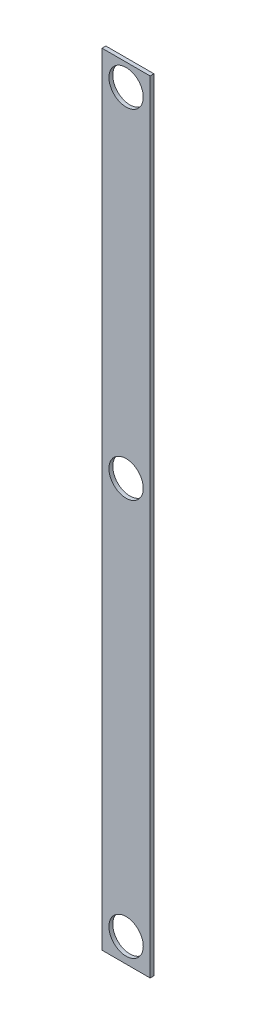
ISO-10303-21;
HEADER;
FILE_DESCRIPTION(('STEP AP214'),'2;1');
FILE_NAME('part.step','',(''),(''),'','','');
FILE_SCHEMA(('AUTOMOTIVE_DESIGN { 1 0 10303 214 1 1 1 1 }'));
ENDSEC;
DATA;
#1=APPLICATION_CONTEXT('core data for automotive mechanical design processes');
#2=APPLICATION_PROTOCOL_DEFINITION('international standard','automotive_design',2000,#1);
#3=PRODUCT_CONTEXT('',#1,'mechanical');
#4=PRODUCT('Part','Part','',(#3));
#5=PRODUCT_RELATED_PRODUCT_CATEGORY('part','',(#4));
#6=PRODUCT_DEFINITION_FORMATION('','',#4);
#7=PRODUCT_DEFINITION_CONTEXT('part definition',#1,'design');
#8=PRODUCT_DEFINITION('design','',#6,#7);
#9=PRODUCT_DEFINITION_SHAPE('','',#8);
#10=(LENGTH_UNIT() NAMED_UNIT(*) SI_UNIT(.MILLI.,.METRE.));
#11=(NAMED_UNIT(*) PLANE_ANGLE_UNIT() SI_UNIT($,.RADIAN.));
#12=(NAMED_UNIT(*) SI_UNIT($,.STERADIAN.) SOLID_ANGLE_UNIT());
#13=UNCERTAINTY_MEASURE_WITH_UNIT(LENGTH_MEASURE(1.E-05),#10,'distance_accuracy_value','');
#14=(GEOMETRIC_REPRESENTATION_CONTEXT(3) GLOBAL_UNCERTAINTY_ASSIGNED_CONTEXT((#13)) GLOBAL_UNIT_ASSIGNED_CONTEXT((#10,
#11,#12)) REPRESENTATION_CONTEXT('',''));
#15=CARTESIAN_POINT('',(0.,0.,0.));
#16=DIRECTION('',(0.,0.,1.));
#17=DIRECTION('',(1.,0.,0.));
#18=AXIS2_PLACEMENT_3D('',#15,#16,#17);
#19=CARTESIAN_POINT('',(0.,0.,3.175));
#20=DIRECTION('',(1.,0.,0.));
#21=DIRECTION('',(0.,1.,0.));
#22=AXIS2_PLACEMENT_3D('',#19,#20,#21);
#23=PLANE('',#22);
#24=DIRECTION('',(0.,-1.,0.));
#25=VECTOR('',#24,1.);
#26=CARTESIAN_POINT('',(0.,0.,0.));
#27=LINE('',#26,#25);
#28=CARTESIAN_POINT('',(0.,0.,0.));
#29=VERTEX_POINT('',#28);
#30=CARTESIAN_POINT('',(0.,-650.,0.));
#31=VERTEX_POINT('',#30);
#32=EDGE_CURVE('E119',#29,#31,#27,.T.);
#33=ORIENTED_EDGE('',*,*,#32,.T.);
#34=DIRECTION('',(0.,0.,-1.));
#35=VECTOR('',#34,1.);
#36=CARTESIAN_POINT('',(0.,-650.,3.175));
#37=LINE('',#36,#35);
#38=CARTESIAN_POINT('',(0.,-650.,3.175));
#39=VERTEX_POINT('',#38);
#40=EDGE_CURVE('E12',#39,#31,#37,.T.);
#41=ORIENTED_EDGE('',*,*,#40,.F.);
#42=DIRECTION('',(0.,-1.,0.));
#43=VECTOR('',#42,1.);
#44=CARTESIAN_POINT('',(0.,0.,3.175));
#45=LINE('',#44,#43);
#46=CARTESIAN_POINT('',(0.,0.,3.175));
#47=VERTEX_POINT('',#46);
#48=EDGE_CURVE('E107',#47,#39,#45,.T.);
#49=ORIENTED_EDGE('',*,*,#48,.F.);
#50=DIRECTION('',(0.,0.,-1.));
#51=VECTOR('',#50,1.);
#52=CARTESIAN_POINT('',(0.,0.,3.175));
#53=LINE('',#52,#51);
#54=EDGE_CURVE('E116',#47,#29,#53,.T.);
#55=ORIENTED_EDGE('',*,*,#54,.T.);
#56=EDGE_LOOP('',(#33,#41,#49,#55));
#57=FACE_BOUND('',#56,.T.);
#58=ADVANCED_FACE('F60',(#57),#23,.F.);
#59=CARTESIAN_POINT('',(0.,-650.,3.175));
#60=DIRECTION('',(0.,1.,0.));
#61=DIRECTION('',(0.,0.,1.));
#62=AXIS2_PLACEMENT_3D('',#59,#60,#61);
#63=PLANE('',#62);
#64=DIRECTION('',(1.,0.,0.));
#65=VECTOR('',#64,1.);
#66=CARTESIAN_POINT('',(0.,-650.,0.));
#67=LINE('',#66,#65);
#68=CARTESIAN_POINT('',(40.0000000000001,-650.,0.));
#69=VERTEX_POINT('',#68);
#70=EDGE_CURVE('E115',#31,#69,#67,.T.);
#71=ORIENTED_EDGE('',*,*,#70,.T.);
#72=DIRECTION('',(0.,0.,-1.));
#73=VECTOR('',#72,1.);
#74=CARTESIAN_POINT('',(40.0000000000001,-650.,3.175));
#75=LINE('',#74,#73);
#76=CARTESIAN_POINT('',(40.0000000000001,-650.,3.175));
#77=VERTEX_POINT('',#76);
#78=EDGE_CURVE('E64',#77,#69,#75,.T.);
#79=ORIENTED_EDGE('',*,*,#78,.F.);
#80=DIRECTION('',(1.,0.,0.));
#81=VECTOR('',#80,1.);
#82=CARTESIAN_POINT('',(0.,-650.,3.175));
#83=LINE('',#82,#81);
#84=EDGE_CURVE('E103',#39,#77,#83,.T.);
#85=ORIENTED_EDGE('',*,*,#84,.F.);
#86=ORIENTED_EDGE('',*,*,#40,.T.);
#87=EDGE_LOOP('',(#71,#79,#85,#86));
#88=FACE_BOUND('',#87,.T.);
#89=ADVANCED_FACE('F112',(#88),#63,.F.);
#90=CARTESIAN_POINT('',(40.,0.,3.175));
#91=DIRECTION('',(-1.,0.,0.));
#92=DIRECTION('',(0.,-1.,0.));
#93=AXIS2_PLACEMENT_3D('',#90,#91,#92);
#94=PLANE('',#93);
#95=DIRECTION('',(0.,1.,0.));
#96=VECTOR('',#95,1.);
#97=CARTESIAN_POINT('',(40.,0.,0.));
#98=LINE('',#97,#96);
#99=CARTESIAN_POINT('',(40.,0.,0.));
#100=VERTEX_POINT('',#99);
#101=EDGE_CURVE('E89',#69,#100,#98,.T.);
#102=ORIENTED_EDGE('',*,*,#101,.T.);
#103=DIRECTION('',(0.,0.,-1.));
#104=VECTOR('',#103,1.);
#105=CARTESIAN_POINT('',(40.,0.,3.175));
#106=LINE('',#105,#104);
#107=CARTESIAN_POINT('',(40.,0.,3.175));
#108=VERTEX_POINT('',#107);
#109=EDGE_CURVE('E114',#108,#100,#106,.T.);
#110=ORIENTED_EDGE('',*,*,#109,.F.);
#111=DIRECTION('',(0.,1.,0.));
#112=VECTOR('',#111,1.);
#113=CARTESIAN_POINT('',(40.,0.,3.175));
#114=LINE('',#113,#112);
#115=EDGE_CURVE('E106',#77,#108,#114,.T.);
#116=ORIENTED_EDGE('',*,*,#115,.F.);
#117=ORIENTED_EDGE('',*,*,#78,.T.);
#118=EDGE_LOOP('',(#102,#110,#116,#117));
#119=FACE_BOUND('',#118,.T.);
#120=ADVANCED_FACE('F111',(#119),#94,.F.);
#121=CARTESIAN_POINT('',(0.,0.,3.175));
#122=DIRECTION('',(0.,-1.,0.));
#123=DIRECTION('',(0.,0.,-1.));
#124=AXIS2_PLACEMENT_3D('',#121,#122,#123);
#125=PLANE('',#124);
#126=DIRECTION('',(-1.,0.,0.));
#127=VECTOR('',#126,1.);
#128=CARTESIAN_POINT('',(0.,0.,0.));
#129=LINE('',#128,#127);
#130=EDGE_CURVE('E96',#100,#29,#129,.T.);
#131=ORIENTED_EDGE('',*,*,#130,.T.);
#132=ORIENTED_EDGE('',*,*,#54,.F.);
#133=DIRECTION('',(-1.,0.,0.));
#134=VECTOR('',#133,1.);
#135=CARTESIAN_POINT('',(0.,0.,3.175));
#136=LINE('',#135,#134);
#137=EDGE_CURVE('E71',#108,#47,#136,.T.);
#138=ORIENTED_EDGE('',*,*,#137,.F.);
#139=ORIENTED_EDGE('',*,*,#109,.T.);
#140=EDGE_LOOP('',(#131,#132,#138,#139));
#141=FACE_BOUND('',#140,.T.);
#142=ADVANCED_FACE('F126',(#141),#125,.F.);
#143=CARTESIAN_POINT('',(0.,0.,3.175));
#144=DIRECTION('',(0.,0.,1.));
#145=DIRECTION('',(1.,0.,0.));
#146=AXIS2_PLACEMENT_3D('',#143,#144,#145);
#147=PLANE('',#146);
#148=CARTESIAN_POINT('',(20.,-18.1413640627852,3.175));
#149=DIRECTION('',(0.,0.,1.));
#150=DIRECTION('',(1.,0.,0.));
#151=AXIS2_PLACEMENT_3D('',#148,#149,#150);
#152=CIRCLE('',#151,14.279);
#153=CARTESIAN_POINT('',(34.279,-18.1413640627852,3.175));
#154=VERTEX_POINT('',#153);
#155=EDGE_CURVE('E148',#154,#154,#152,.T.);
#156=ORIENTED_EDGE('',*,*,#155,.F.);
#157=EDGE_LOOP('',(#156));
#158=FACE_BOUND('',#157,.T.);
#159=CARTESIAN_POINT('',(20.,-300.,3.175));
#160=DIRECTION('',(0.,0.,1.));
#161=DIRECTION('',(1.,0.,0.));
#162=AXIS2_PLACEMENT_3D('',#159,#160,#161);
#163=CIRCLE('',#162,14.279);
#164=CARTESIAN_POINT('',(34.279,-300.,3.175));
#165=VERTEX_POINT('',#164);
#166=EDGE_CURVE('E141',#165,#165,#163,.T.);
#167=ORIENTED_EDGE('',*,*,#166,.F.);
#168=EDGE_LOOP('',(#167));
#169=FACE_BOUND('',#168,.T.);
#170=CARTESIAN_POINT('',(20.0000000000001,-630.,3.175));
#171=DIRECTION('',(0.,0.,1.));
#172=DIRECTION('',(1.,0.,0.));
#173=AXIS2_PLACEMENT_3D('',#170,#171,#172);
#174=CIRCLE('',#173,14.279);
#175=CARTESIAN_POINT('',(34.2790000000001,-630.,3.175));
#176=VERTEX_POINT('',#175);
#177=EDGE_CURVE('E136',#176,#176,#174,.T.);
#178=ORIENTED_EDGE('',*,*,#177,.F.);
#179=EDGE_LOOP('',(#178));
#180=FACE_BOUND('',#179,.T.);
#181=ORIENTED_EDGE('',*,*,#48,.T.);
#182=ORIENTED_EDGE('',*,*,#84,.T.);
#183=ORIENTED_EDGE('',*,*,#115,.T.);
#184=ORIENTED_EDGE('',*,*,#137,.T.);
#185=EDGE_LOOP('',(#181,#182,#183,#184));
#186=FACE_BOUND('',#185,.T.);
#187=ADVANCED_FACE('F102',(#158,#169,#180,#186),#147,.T.);
#188=CARTESIAN_POINT('',(0.,0.,0.));
#189=DIRECTION('',(0.,0.,1.));
#190=DIRECTION('',(1.,0.,0.));
#191=AXIS2_PLACEMENT_3D('',#188,#189,#190);
#192=PLANE('',#191);
#193=CARTESIAN_POINT('',(20.,-18.1413640627852,0.));
#194=DIRECTION('',(0.,0.,1.));
#195=DIRECTION('',(1.,0.,0.));
#196=AXIS2_PLACEMENT_3D('',#193,#194,#195);
#197=CIRCLE('',#196,14.279);
#198=CARTESIAN_POINT('',(34.279,-18.1413640627852,0.));
#199=VERTEX_POINT('',#198);
#200=EDGE_CURVE('E125',#199,#199,#197,.T.);
#201=ORIENTED_EDGE('',*,*,#200,.T.);
#202=EDGE_LOOP('',(#201));
#203=FACE_BOUND('',#202,.T.);
#204=CARTESIAN_POINT('',(20.,-300.,0.));
#205=DIRECTION('',(0.,0.,1.));
#206=DIRECTION('',(1.,0.,0.));
#207=AXIS2_PLACEMENT_3D('',#204,#205,#206);
#208=CIRCLE('',#207,14.279);
#209=CARTESIAN_POINT('',(34.279,-300.,0.));
#210=VERTEX_POINT('',#209);
#211=EDGE_CURVE('E137',#210,#210,#208,.T.);
#212=ORIENTED_EDGE('',*,*,#211,.T.);
#213=EDGE_LOOP('',(#212));
#214=FACE_BOUND('',#213,.T.);
#215=CARTESIAN_POINT('',(20.0000000000001,-630.,0.));
#216=DIRECTION('',(0.,0.,1.));
#217=DIRECTION('',(1.,0.,0.));
#218=AXIS2_PLACEMENT_3D('',#215,#216,#217);
#219=CIRCLE('',#218,14.279);
#220=CARTESIAN_POINT('',(34.2790000000001,-630.,0.));
#221=VERTEX_POINT('',#220);
#222=EDGE_CURVE('E133',#221,#221,#219,.T.);
#223=ORIENTED_EDGE('',*,*,#222,.T.);
#224=EDGE_LOOP('',(#223));
#225=FACE_BOUND('',#224,.T.);
#226=ORIENTED_EDGE('',*,*,#32,.F.);
#227=ORIENTED_EDGE('',*,*,#130,.F.);
#228=ORIENTED_EDGE('',*,*,#101,.F.);
#229=ORIENTED_EDGE('',*,*,#70,.F.);
#230=EDGE_LOOP('',(#226,#227,#228,#229));
#231=FACE_BOUND('',#230,.T.);
#232=ADVANCED_FACE('F131',(#203,#214,#225,#231),#192,.F.);
#233=CARTESIAN_POINT('',(20.0000000000001,-630.,0.));
#234=DIRECTION('',(0.,0.,1.));
#235=DIRECTION('',(1.,0.,0.));
#236=AXIS2_PLACEMENT_3D('',#233,#234,#235);
#237=CYLINDRICAL_SURFACE('',#236,14.279);
#238=ORIENTED_EDGE('',*,*,#222,.F.);
#239=EDGE_LOOP('',(#238));
#240=FACE_BOUND('',#239,.T.);
#241=ORIENTED_EDGE('',*,*,#177,.T.);
#242=EDGE_LOOP('',(#241));
#243=FACE_BOUND('',#242,.T.);
#244=ADVANCED_FACE('F169',(#240,#243),#237,.F.);
#245=CARTESIAN_POINT('',(20.,-300.,0.));
#246=DIRECTION('',(0.,0.,1.));
#247=DIRECTION('',(1.,0.,0.));
#248=AXIS2_PLACEMENT_3D('',#245,#246,#247);
#249=CYLINDRICAL_SURFACE('',#248,14.279);
#250=ORIENTED_EDGE('',*,*,#211,.F.);
#251=EDGE_LOOP('',(#250));
#252=FACE_BOUND('',#251,.T.);
#253=ORIENTED_EDGE('',*,*,#166,.T.);
#254=EDGE_LOOP('',(#253));
#255=FACE_BOUND('',#254,.T.);
#256=ADVANCED_FACE('F160',(#252,#255),#249,.F.);
#257=CARTESIAN_POINT('',(20.,-18.1413640627852,0.));
#258=DIRECTION('',(0.,0.,1.));
#259=DIRECTION('',(1.,0.,0.));
#260=AXIS2_PLACEMENT_3D('',#257,#258,#259);
#261=CYLINDRICAL_SURFACE('',#260,14.279);
#262=ORIENTED_EDGE('',*,*,#200,.F.);
#263=EDGE_LOOP('',(#262));
#264=FACE_BOUND('',#263,.T.);
#265=ORIENTED_EDGE('',*,*,#155,.T.);
#266=EDGE_LOOP('',(#265));
#267=FACE_BOUND('',#266,.T.);
#268=ADVANCED_FACE('F152',(#264,#267),#261,.F.);
#269=CLOSED_SHELL('',(#58,#89,#120,#142,#187,#232,#244,#256,#268));
#270=MANIFOLD_SOLID_BREP('B2',#269);
#271=ADVANCED_BREP_SHAPE_REPRESENTATION('',(#18,#270),#14);
#272=SHAPE_DEFINITION_REPRESENTATION(#9,#271);
ENDSEC;
END-ISO-10303-21;
